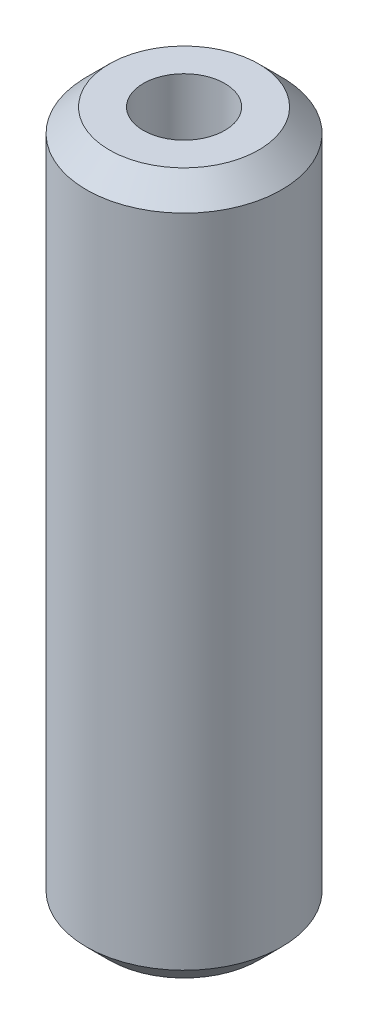
ISO-10303-21;
HEADER;
FILE_DESCRIPTION(('STEP AP214'),'2;1');
FILE_NAME('part.step','',(''),(''),'','','');
FILE_SCHEMA(('AUTOMOTIVE_DESIGN { 1 0 10303 214 1 1 1 1 }'));
ENDSEC;
DATA;
#1=APPLICATION_CONTEXT('core data for automotive mechanical design processes');
#2=APPLICATION_PROTOCOL_DEFINITION('international standard','automotive_design',2000,#1);
#3=PRODUCT_CONTEXT('',#1,'mechanical');
#4=PRODUCT('Part','Part','',(#3));
#5=PRODUCT_RELATED_PRODUCT_CATEGORY('part','',(#4));
#6=PRODUCT_DEFINITION_FORMATION('','',#4);
#7=PRODUCT_DEFINITION_CONTEXT('part definition',#1,'design');
#8=PRODUCT_DEFINITION('design','',#6,#7);
#9=PRODUCT_DEFINITION_SHAPE('','',#8);
#10=(LENGTH_UNIT() NAMED_UNIT(*) SI_UNIT(.MILLI.,.METRE.));
#11=(NAMED_UNIT(*) PLANE_ANGLE_UNIT() SI_UNIT($,.RADIAN.));
#12=(NAMED_UNIT(*) SI_UNIT($,.STERADIAN.) SOLID_ANGLE_UNIT());
#13=UNCERTAINTY_MEASURE_WITH_UNIT(LENGTH_MEASURE(1.E-05),#10,'distance_accuracy_value','');
#14=(GEOMETRIC_REPRESENTATION_CONTEXT(3) GLOBAL_UNCERTAINTY_ASSIGNED_CONTEXT((#13)) GLOBAL_UNIT_ASSIGNED_CONTEXT((#10,
#11,#12)) REPRESENTATION_CONTEXT('',''));
#15=CARTESIAN_POINT('',(0.,0.,0.));
#16=DIRECTION('',(0.,0.,1.));
#17=DIRECTION('',(1.,0.,0.));
#18=AXIS2_PLACEMENT_3D('',#15,#16,#17);
#19=CARTESIAN_POINT('',(0.,143.751886313229,0.));
#20=DIRECTION('',(0.,-1.,0.));
#21=DIRECTION('',(0.,0.,-1.));
#22=AXIS2_PLACEMENT_3D('',#19,#20,#21);
#23=CYLINDRICAL_SURFACE('',#22,20.);
#24=CARTESIAN_POINT('',(0.,139.047206551725,0.));
#25=DIRECTION('',(0.,1.,0.));
#26=DIRECTION('',(0.,0.,1.));
#27=AXIS2_PLACEMENT_3D('',#24,#25,#26);
#28=CIRCLE('',#27,20.);
#29=CARTESIAN_POINT('',(0.,139.047206551725,20.));
#30=VERTEX_POINT('',#29);
#31=EDGE_CURVE('E50',#30,#30,#28,.F.);
#32=ORIENTED_EDGE('',*,*,#31,.T.);
#33=EDGE_LOOP('',(#32));
#34=FACE_BOUND('',#33,.T.);
#35=CARTESIAN_POINT('',(0.,4.70467976150429,0.));
#36=DIRECTION('',(0.,1.,0.));
#37=DIRECTION('',(0.,0.,1.));
#38=AXIS2_PLACEMENT_3D('',#35,#36,#37);
#39=CIRCLE('',#38,20.);
#40=CARTESIAN_POINT('',(0.,4.70467976150429,20.));
#41=VERTEX_POINT('',#40);
#42=EDGE_CURVE('E51',#41,#41,#39,.T.);
#43=ORIENTED_EDGE('',*,*,#42,.T.);
#44=EDGE_LOOP('',(#43));
#45=FACE_BOUND('',#44,.T.);
#46=ADVANCED_FACE('F39',(#34,#45),#23,.T.);
#47=CARTESIAN_POINT('',(0.,143.751886313229,0.));
#48=DIRECTION('',(0.,1.,0.));
#49=DIRECTION('',(0.,0.,1.));
#50=AXIS2_PLACEMENT_3D('',#47,#48,#49);
#51=PLANE('',#50);
#52=CARTESIAN_POINT('',(0.,143.751886313229,0.));
#53=DIRECTION('',(0.,1.,0.));
#54=DIRECTION('',(0.,0.,1.));
#55=AXIS2_PLACEMENT_3D('',#52,#53,#54);
#56=CIRCLE('',#55,15.2953202384957);
#57=CARTESIAN_POINT('',(0.,143.751886313229,15.2953202384957));
#58=VERTEX_POINT('',#57);
#59=EDGE_CURVE('E54',#58,#58,#56,.T.);
#60=ORIENTED_EDGE('',*,*,#59,.T.);
#61=EDGE_LOOP('',(#60));
#62=FACE_BOUND('',#61,.T.);
#63=CARTESIAN_POINT('',(0.,143.751886313229,0.));
#64=DIRECTION('',(0.,1.,0.));
#65=DIRECTION('',(0.,0.,1.));
#66=AXIS2_PLACEMENT_3D('',#63,#64,#65);
#67=CIRCLE('',#66,8.34623377876386);
#68=CARTESIAN_POINT('',(0.,143.751886313229,8.34623377876386));
#69=VERTEX_POINT('',#68);
#70=EDGE_CURVE('E58',#69,#69,#67,.T.);
#71=ORIENTED_EDGE('',*,*,#70,.F.);
#72=EDGE_LOOP('',(#71));
#73=FACE_BOUND('',#72,.T.);
#74=ADVANCED_FACE('F69',(#62,#73),#51,.T.);
#75=CARTESIAN_POINT('',(0.,0.,0.));
#76=DIRECTION('',(0.,1.,0.));
#77=DIRECTION('',(0.,0.,1.));
#78=AXIS2_PLACEMENT_3D('',#75,#76,#77);
#79=PLANE('',#78);
#80=CARTESIAN_POINT('',(0.,0.,0.));
#81=DIRECTION('',(0.,1.,0.));
#82=DIRECTION('',(0.,0.,1.));
#83=AXIS2_PLACEMENT_3D('',#80,#81,#82);
#84=CIRCLE('',#83,15.2953202384957);
#85=CARTESIAN_POINT('',(0.,0.,15.2953202384957));
#86=VERTEX_POINT('',#85);
#87=EDGE_CURVE('E10',#86,#86,#84,.F.);
#88=ORIENTED_EDGE('',*,*,#87,.T.);
#89=EDGE_LOOP('',(#88));
#90=FACE_BOUND('',#89,.T.);
#91=CARTESIAN_POINT('',(0.,0.,0.));
#92=DIRECTION('',(0.,1.,0.));
#93=DIRECTION('',(0.,0.,1.));
#94=AXIS2_PLACEMENT_3D('',#91,#92,#93);
#95=CIRCLE('',#94,8.34623377876386);
#96=CARTESIAN_POINT('',(0.,0.,8.34623377876386));
#97=VERTEX_POINT('',#96);
#98=EDGE_CURVE('E63',#97,#97,#95,.T.);
#99=ORIENTED_EDGE('',*,*,#98,.T.);
#100=EDGE_LOOP('',(#99));
#101=FACE_BOUND('',#100,.T.);
#102=ADVANCED_FACE('F75',(#90,#101),#79,.F.);
#103=CARTESIAN_POINT('',(0.,143.751886313229,0.));
#104=DIRECTION('',(0.,-1.,0.));
#105=DIRECTION('',(0.,0.,-1.));
#106=AXIS2_PLACEMENT_3D('',#103,#104,#105);
#107=CYLINDRICAL_SURFACE('',#106,8.34623377876386);
#108=ORIENTED_EDGE('',*,*,#70,.T.);
#109=EDGE_LOOP('',(#108));
#110=FACE_BOUND('',#109,.T.);
#111=ORIENTED_EDGE('',*,*,#98,.F.);
#112=EDGE_LOOP('',(#111));
#113=FACE_BOUND('',#112,.T.);
#114=ADVANCED_FACE('F70',(#110,#113),#107,.F.);
#115=CARTESIAN_POINT('',(0.,143.751886313229,0.));
#116=DIRECTION('',(0.,-1.,0.));
#117=DIRECTION('',(0.,0.,-1.));
#118=AXIS2_PLACEMENT_3D('',#115,#116,#117);
#119=CONICAL_SURFACE('',#118,15.2953202384957,0.785398163397448);
#120=ORIENTED_EDGE('',*,*,#31,.F.);
#121=EDGE_LOOP('',(#120));
#122=FACE_BOUND('',#121,.T.);
#123=ORIENTED_EDGE('',*,*,#59,.F.);
#124=EDGE_LOOP('',(#123));
#125=FACE_BOUND('',#124,.T.);
#126=ADVANCED_FACE('F81',(#122,#125),#119,.T.);
#127=CARTESIAN_POINT('',(0.,4.70467976150429,0.));
#128=DIRECTION('',(0.,1.,0.));
#129=DIRECTION('',(0.,0.,1.));
#130=AXIS2_PLACEMENT_3D('',#127,#128,#129);
#131=CONICAL_SURFACE('',#130,20.,0.785398163397451);
#132=ORIENTED_EDGE('',*,*,#87,.F.);
#133=EDGE_LOOP('',(#132));
#134=FACE_BOUND('',#133,.T.);
#135=ORIENTED_EDGE('',*,*,#42,.F.);
#136=EDGE_LOOP('',(#135));
#137=FACE_BOUND('',#136,.T.);
#138=ADVANCED_FACE('F45',(#134,#137),#131,.T.);
#139=CLOSED_SHELL('',(#46,#74,#102,#114,#126,#138));
#140=MANIFOLD_SOLID_BREP('B2',#139);
#141=ADVANCED_BREP_SHAPE_REPRESENTATION('',(#18,#140),#14);
#142=SHAPE_DEFINITION_REPRESENTATION(#9,#141);
ENDSEC;
END-ISO-10303-21;
